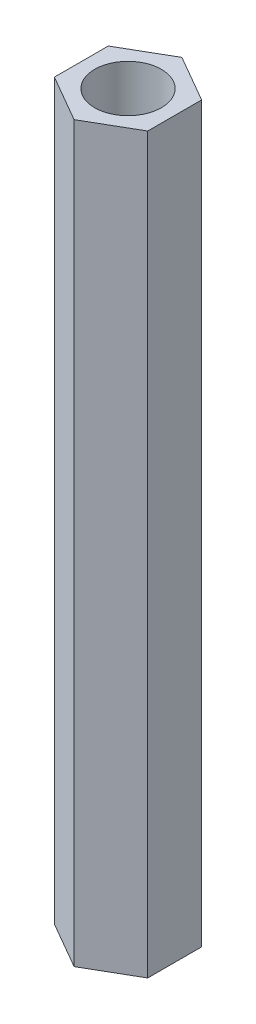
ISO-10303-21;
HEADER;
FILE_DESCRIPTION(('STEP AP214'),'2;1');
FILE_NAME('part.step','',(''),(''),'','','');
FILE_SCHEMA(('AUTOMOTIVE_DESIGN { 1 0 10303 214 1 1 1 1 }'));
ENDSEC;
DATA;
#1=APPLICATION_CONTEXT('core data for automotive mechanical design processes');
#2=APPLICATION_PROTOCOL_DEFINITION('international standard','automotive_design',2000,#1);
#3=PRODUCT_CONTEXT('',#1,'mechanical');
#4=PRODUCT('Part','Part','',(#3));
#5=PRODUCT_RELATED_PRODUCT_CATEGORY('part','',(#4));
#6=PRODUCT_DEFINITION_FORMATION('','',#4);
#7=PRODUCT_DEFINITION_CONTEXT('part definition',#1,'design');
#8=PRODUCT_DEFINITION('design','',#6,#7);
#9=PRODUCT_DEFINITION_SHAPE('','',#8);
#10=(LENGTH_UNIT() NAMED_UNIT(*) SI_UNIT(.MILLI.,.METRE.));
#11=(NAMED_UNIT(*) PLANE_ANGLE_UNIT() SI_UNIT($,.RADIAN.));
#12=(NAMED_UNIT(*) SI_UNIT($,.STERADIAN.) SOLID_ANGLE_UNIT());
#13=UNCERTAINTY_MEASURE_WITH_UNIT(LENGTH_MEASURE(1.E-05),#10,'distance_accuracy_value','');
#14=(GEOMETRIC_REPRESENTATION_CONTEXT(3) GLOBAL_UNCERTAINTY_ASSIGNED_CONTEXT((#13)) GLOBAL_UNIT_ASSIGNED_CONTEXT((#10,
#11,#12)) REPRESENTATION_CONTEXT('',''));
#15=CARTESIAN_POINT('',(0.,0.,0.));
#16=DIRECTION('',(0.,0.,1.));
#17=DIRECTION('',(1.,0.,0.));
#18=AXIS2_PLACEMENT_3D('',#15,#16,#17);
#19=CARTESIAN_POINT('',(0.,55.,0.));
#20=DIRECTION('',(0.,1.,0.));
#21=DIRECTION('',(0.,0.,1.));
#22=AXIS2_PLACEMENT_3D('',#19,#20,#21);
#23=PLANE('',#22);
#24=DIRECTION('',(-0.866025403784442,0.,-0.499999999999995));
#25=VECTOR('',#24,1.);
#26=CARTESIAN_POINT('',(3.49999999999998,55.,-2.02072594216373));
#27=LINE('',#26,#25);
#28=CARTESIAN_POINT('',(3.49999999999998,55.,-2.02072594216373));
#29=VERTEX_POINT('',#28);
#30=CARTESIAN_POINT('',(0.,55.,-4.04145188432738));
#31=VERTEX_POINT('',#30);
#32=EDGE_CURVE('E131',#29,#31,#27,.T.);
#33=ORIENTED_EDGE('',*,*,#32,.T.);
#34=DIRECTION('',(-0.866025403784438,0.,0.500000000000001));
#35=VECTOR('',#34,1.);
#36=CARTESIAN_POINT('',(0.,55.,-4.04145188432738));
#37=LINE('',#36,#35);
#38=CARTESIAN_POINT('',(-3.50000000000001,55.,-2.02072594216368));
#39=VERTEX_POINT('',#38);
#40=EDGE_CURVE('E89',#31,#39,#37,.T.);
#41=ORIENTED_EDGE('',*,*,#40,.T.);
#42=DIRECTION('',(0.,0.,1.));
#43=VECTOR('',#42,1.);
#44=CARTESIAN_POINT('',(-3.50000000000001,55.,-2.02072594216368));
#45=LINE('',#44,#43);
#46=CARTESIAN_POINT('',(-3.49999999999999,55.,2.02072594216371));
#47=VERTEX_POINT('',#46);
#48=EDGE_CURVE('E102',#39,#47,#45,.T.);
#49=ORIENTED_EDGE('',*,*,#48,.T.);
#50=DIRECTION('',(0.866025403784441,0.,0.499999999999995));
#51=VECTOR('',#50,1.);
#52=CARTESIAN_POINT('',(-3.49999999999999,55.,2.02072594216371));
#53=LINE('',#52,#51);
#54=CARTESIAN_POINT('',(0.,55.,4.04145188432738));
#55=VERTEX_POINT('',#54);
#56=EDGE_CURVE('E96',#47,#55,#53,.T.);
#57=ORIENTED_EDGE('',*,*,#56,.T.);
#58=DIRECTION('',(0.866025403784435,0.,-0.500000000000007));
#59=VECTOR('',#58,1.);
#60=CARTESIAN_POINT('',(0.,55.,4.04145188432738));
#61=LINE('',#60,#59);
#62=CARTESIAN_POINT('',(3.50000000000002,55.,2.02072594216366));
#63=VERTEX_POINT('',#62);
#64=EDGE_CURVE('E100',#55,#63,#61,.T.);
#65=ORIENTED_EDGE('',*,*,#64,.T.);
#66=DIRECTION('',(0.,0.,-1.));
#67=VECTOR('',#66,1.);
#68=CARTESIAN_POINT('',(3.50000000000002,55.,2.02072594216366));
#69=LINE('',#68,#67);
#70=EDGE_CURVE('E52',#63,#29,#69,.T.);
#71=ORIENTED_EDGE('',*,*,#70,.T.);
#72=EDGE_LOOP('',(#33,#41,#49,#57,#65,#71));
#73=FACE_BOUND('',#72,.T.);
#74=CARTESIAN_POINT('',(0.,55.,0.));
#75=DIRECTION('',(0.,1.,0.));
#76=DIRECTION('',(0.,0.,1.));
#77=AXIS2_PLACEMENT_3D('',#74,#75,#76);
#78=CIRCLE('',#77,2.5);
#79=CARTESIAN_POINT('',(0.,55.,2.5));
#80=VERTEX_POINT('',#79);
#81=EDGE_CURVE('E124',#80,#80,#78,.T.);
#82=ORIENTED_EDGE('',*,*,#81,.F.);
#83=EDGE_LOOP('',(#82));
#84=FACE_BOUND('',#83,.T.);
#85=ADVANCED_FACE('F35',(#73,#84),#23,.T.);
#86=CARTESIAN_POINT('',(0.,0.,0.));
#87=DIRECTION('',(0.,1.,0.));
#88=DIRECTION('',(0.,0.,1.));
#89=AXIS2_PLACEMENT_3D('',#86,#87,#88);
#90=PLANE('',#89);
#91=DIRECTION('',(-0.866025403784442,0.,-0.499999999999995));
#92=VECTOR('',#91,1.);
#93=CARTESIAN_POINT('',(3.49999999999998,0.,-2.02072594216373));
#94=LINE('',#93,#92);
#95=CARTESIAN_POINT('',(3.49999999999998,0.,-2.02072594216373));
#96=VERTEX_POINT('',#95);
#97=CARTESIAN_POINT('',(0.,0.,-4.04145188432738));
#98=VERTEX_POINT('',#97);
#99=EDGE_CURVE('E120',#96,#98,#94,.T.);
#100=ORIENTED_EDGE('',*,*,#99,.F.);
#101=DIRECTION('',(0.,0.,-1.));
#102=VECTOR('',#101,1.);
#103=CARTESIAN_POINT('',(3.50000000000002,0.,2.02072594216366));
#104=LINE('',#103,#102);
#105=CARTESIAN_POINT('',(3.50000000000002,0.,2.02072594216366));
#106=VERTEX_POINT('',#105);
#107=EDGE_CURVE('E81',#106,#96,#104,.T.);
#108=ORIENTED_EDGE('',*,*,#107,.F.);
#109=DIRECTION('',(0.866025403784435,0.,-0.500000000000007));
#110=VECTOR('',#109,1.);
#111=CARTESIAN_POINT('',(0.,0.,4.04145188432738));
#112=LINE('',#111,#110);
#113=CARTESIAN_POINT('',(0.,0.,4.04145188432738));
#114=VERTEX_POINT('',#113);
#115=EDGE_CURVE('E75',#114,#106,#112,.T.);
#116=ORIENTED_EDGE('',*,*,#115,.F.);
#117=DIRECTION('',(0.866025403784441,0.,0.499999999999995));
#118=VECTOR('',#117,1.);
#119=CARTESIAN_POINT('',(-3.49999999999999,0.,2.02072594216371));
#120=LINE('',#119,#118);
#121=CARTESIAN_POINT('',(-3.49999999999999,0.,2.02072594216371));
#122=VERTEX_POINT('',#121);
#123=EDGE_CURVE('E110',#122,#114,#120,.T.);
#124=ORIENTED_EDGE('',*,*,#123,.F.);
#125=DIRECTION('',(0.,0.,1.));
#126=VECTOR('',#125,1.);
#127=CARTESIAN_POINT('',(-3.50000000000001,0.,-2.02072594216368));
#128=LINE('',#127,#126);
#129=CARTESIAN_POINT('',(-3.50000000000001,0.,-2.02072594216368));
#130=VERTEX_POINT('',#129);
#131=EDGE_CURVE('E126',#130,#122,#128,.T.);
#132=ORIENTED_EDGE('',*,*,#131,.F.);
#133=DIRECTION('',(-0.866025403784438,0.,0.500000000000001));
#134=VECTOR('',#133,1.);
#135=CARTESIAN_POINT('',(0.,0.,-4.04145188432738));
#136=LINE('',#135,#134);
#137=EDGE_CURVE('E123',#98,#130,#136,.T.);
#138=ORIENTED_EDGE('',*,*,#137,.F.);
#139=EDGE_LOOP('',(#100,#108,#116,#124,#132,#138));
#140=FACE_BOUND('',#139,.T.);
#141=CARTESIAN_POINT('',(0.,0.,0.));
#142=DIRECTION('',(0.,1.,0.));
#143=DIRECTION('',(0.,0.,1.));
#144=AXIS2_PLACEMENT_3D('',#141,#142,#143);
#145=CIRCLE('',#144,2.5);
#146=CARTESIAN_POINT('',(0.,0.,2.5));
#147=VERTEX_POINT('',#146);
#148=EDGE_CURVE('E224',#147,#147,#145,.T.);
#149=ORIENTED_EDGE('',*,*,#148,.T.);
#150=EDGE_LOOP('',(#149));
#151=FACE_BOUND('',#150,.T.);
#152=ADVANCED_FACE('F140',(#140,#151),#90,.F.);
#153=CARTESIAN_POINT('',(3.49999999999998,55.,-2.02072594216373));
#154=DIRECTION('',(-0.499999999999995,0.,0.866025403784442));
#155=DIRECTION('',(0.866025403784442,0.,0.499999999999995));
#156=AXIS2_PLACEMENT_3D('',#153,#154,#155);
#157=PLANE('',#156);
#158=ORIENTED_EDGE('',*,*,#99,.T.);
#159=DIRECTION('',(0.,-1.,0.));
#160=VECTOR('',#159,1.);
#161=CARTESIAN_POINT('',(0.,55.,-4.04145188432738));
#162=LINE('',#161,#160);
#163=EDGE_CURVE('E11',#31,#98,#162,.T.);
#164=ORIENTED_EDGE('',*,*,#163,.F.);
#165=ORIENTED_EDGE('',*,*,#32,.F.);
#166=DIRECTION('',(0.,-1.,0.));
#167=VECTOR('',#166,1.);
#168=CARTESIAN_POINT('',(3.49999999999998,55.,-2.02072594216373));
#169=LINE('',#168,#167);
#170=EDGE_CURVE('E116',#29,#96,#169,.T.);
#171=ORIENTED_EDGE('',*,*,#170,.T.);
#172=EDGE_LOOP('',(#158,#164,#165,#171));
#173=FACE_BOUND('',#172,.T.);
#174=ADVANCED_FACE('F37',(#173),#157,.F.);
#175=CARTESIAN_POINT('',(0.,55.,-4.04145188432738));
#176=DIRECTION('',(0.500000000000001,0.,0.866025403784438));
#177=DIRECTION('',(0.866025403784438,0.,-0.500000000000001));
#178=AXIS2_PLACEMENT_3D('',#175,#176,#177);
#179=PLANE('',#178);
#180=ORIENTED_EDGE('',*,*,#137,.T.);
#181=DIRECTION('',(0.,-1.,0.));
#182=VECTOR('',#181,1.);
#183=CARTESIAN_POINT('',(-3.50000000000001,55.,-2.02072594216368));
#184=LINE('',#183,#182);
#185=EDGE_CURVE('E44',#39,#130,#184,.T.);
#186=ORIENTED_EDGE('',*,*,#185,.F.);
#187=ORIENTED_EDGE('',*,*,#40,.F.);
#188=ORIENTED_EDGE('',*,*,#163,.T.);
#189=EDGE_LOOP('',(#180,#186,#187,#188));
#190=FACE_BOUND('',#189,.T.);
#191=ADVANCED_FACE('F165',(#190),#179,.F.);
#192=CARTESIAN_POINT('',(-3.50000000000001,55.,-2.02072594216368));
#193=DIRECTION('',(1.,0.,0.));
#194=DIRECTION('',(0.,0.,-1.));
#195=AXIS2_PLACEMENT_3D('',#192,#193,#194);
#196=PLANE('',#195);
#197=ORIENTED_EDGE('',*,*,#131,.T.);
#198=DIRECTION('',(0.,-1.,0.));
#199=VECTOR('',#198,1.);
#200=CARTESIAN_POINT('',(-3.49999999999999,55.,2.02072594216371));
#201=LINE('',#200,#199);
#202=EDGE_CURVE('E111',#47,#122,#201,.T.);
#203=ORIENTED_EDGE('',*,*,#202,.F.);
#204=ORIENTED_EDGE('',*,*,#48,.F.);
#205=ORIENTED_EDGE('',*,*,#185,.T.);
#206=EDGE_LOOP('',(#197,#203,#204,#205));
#207=FACE_BOUND('',#206,.T.);
#208=ADVANCED_FACE('F137',(#207),#196,.F.);
#209=CARTESIAN_POINT('',(-3.49999999999999,55.,2.02072594216371));
#210=DIRECTION('',(0.499999999999995,0.,-0.866025403784441));
#211=DIRECTION('',(-0.866025403784441,0.,-0.499999999999995));
#212=AXIS2_PLACEMENT_3D('',#209,#210,#211);
#213=PLANE('',#212);
#214=ORIENTED_EDGE('',*,*,#123,.T.);
#215=DIRECTION('',(0.,-1.,0.));
#216=VECTOR('',#215,1.);
#217=CARTESIAN_POINT('',(0.,55.,4.04145188432738));
#218=LINE('',#217,#216);
#219=EDGE_CURVE('E107',#55,#114,#218,.T.);
#220=ORIENTED_EDGE('',*,*,#219,.F.);
#221=ORIENTED_EDGE('',*,*,#56,.F.);
#222=ORIENTED_EDGE('',*,*,#202,.T.);
#223=EDGE_LOOP('',(#214,#220,#221,#222));
#224=FACE_BOUND('',#223,.T.);
#225=ADVANCED_FACE('F108',(#224),#213,.F.);
#226=CARTESIAN_POINT('',(0.,55.,4.04145188432738));
#227=DIRECTION('',(-0.500000000000007,0.,-0.866025403784435));
#228=DIRECTION('',(-0.866025403784434,0.,0.500000000000007));
#229=AXIS2_PLACEMENT_3D('',#226,#227,#228);
#230=PLANE('',#229);
#231=ORIENTED_EDGE('',*,*,#115,.T.);
#232=DIRECTION('',(0.,-1.,0.));
#233=VECTOR('',#232,1.);
#234=CARTESIAN_POINT('',(3.50000000000002,55.,2.02072594216366));
#235=LINE('',#234,#233);
#236=EDGE_CURVE('E112',#63,#106,#235,.T.);
#237=ORIENTED_EDGE('',*,*,#236,.F.);
#238=ORIENTED_EDGE('',*,*,#64,.F.);
#239=ORIENTED_EDGE('',*,*,#219,.T.);
#240=EDGE_LOOP('',(#231,#237,#238,#239));
#241=FACE_BOUND('',#240,.T.);
#242=ADVANCED_FACE('F114',(#241),#230,.F.);
#243=CARTESIAN_POINT('',(3.50000000000002,55.,2.02072594216366));
#244=DIRECTION('',(-1.,0.,0.));
#245=DIRECTION('',(0.,0.,1.));
#246=AXIS2_PLACEMENT_3D('',#243,#244,#245);
#247=PLANE('',#246);
#248=ORIENTED_EDGE('',*,*,#107,.T.);
#249=ORIENTED_EDGE('',*,*,#170,.F.);
#250=ORIENTED_EDGE('',*,*,#70,.F.);
#251=ORIENTED_EDGE('',*,*,#236,.T.);
#252=EDGE_LOOP('',(#248,#249,#250,#251));
#253=FACE_BOUND('',#252,.T.);
#254=ADVANCED_FACE('F145',(#253),#247,.F.);
#255=CARTESIAN_POINT('',(0.,55.,0.));
#256=DIRECTION('',(0.,-1.,0.));
#257=DIRECTION('',(0.,0.,-1.));
#258=AXIS2_PLACEMENT_3D('',#255,#256,#257);
#259=CYLINDRICAL_SURFACE('',#258,2.5);
#260=ORIENTED_EDGE('',*,*,#81,.T.);
#261=EDGE_LOOP('',(#260));
#262=FACE_BOUND('',#261,.T.);
#263=ORIENTED_EDGE('',*,*,#148,.F.);
#264=EDGE_LOOP('',(#263));
#265=FACE_BOUND('',#264,.T.);
#266=ADVANCED_FACE('F147',(#262,#265),#259,.F.);
#267=CLOSED_SHELL('',(#85,#152,#174,#191,#208,#225,#242,#254,#266));
#268=MANIFOLD_SOLID_BREP('B2',#267);
#269=ADVANCED_BREP_SHAPE_REPRESENTATION('',(#18,#268),#14);
#270=SHAPE_DEFINITION_REPRESENTATION(#9,#269);
ENDSEC;
END-ISO-10303-21;
